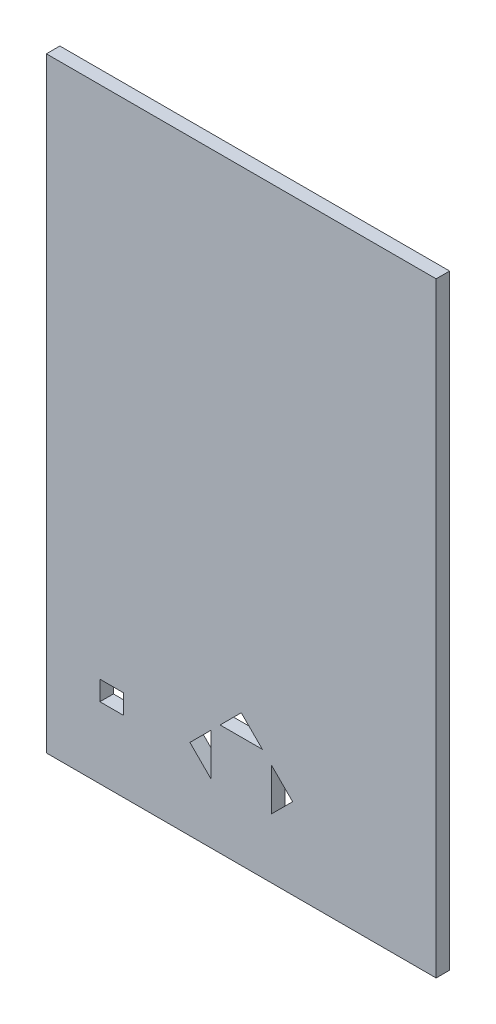
ISO-10303-21;
HEADER;
FILE_DESCRIPTION(('STEP AP214'),'2;1');
FILE_NAME('part.step','',(''),(''),'','','');
FILE_SCHEMA(('AUTOMOTIVE_DESIGN { 1 0 10303 214 1 1 1 1 }'));
ENDSEC;
DATA;
#1=APPLICATION_CONTEXT('core data for automotive mechanical design processes');
#2=APPLICATION_PROTOCOL_DEFINITION('international standard','automotive_design',2000,#1);
#3=PRODUCT_CONTEXT('',#1,'mechanical');
#4=PRODUCT('Part','Part','',(#3));
#5=PRODUCT_RELATED_PRODUCT_CATEGORY('part','',(#4));
#6=PRODUCT_DEFINITION_FORMATION('','',#4);
#7=PRODUCT_DEFINITION_CONTEXT('part definition',#1,'design');
#8=PRODUCT_DEFINITION('design','',#6,#7);
#9=PRODUCT_DEFINITION_SHAPE('','',#8);
#10=(LENGTH_UNIT() NAMED_UNIT(*) SI_UNIT(.MILLI.,.METRE.));
#11=(NAMED_UNIT(*) PLANE_ANGLE_UNIT() SI_UNIT($,.RADIAN.));
#12=(NAMED_UNIT(*) SI_UNIT($,.STERADIAN.) SOLID_ANGLE_UNIT());
#13=UNCERTAINTY_MEASURE_WITH_UNIT(LENGTH_MEASURE(1.E-05),#10,'distance_accuracy_value','');
#14=(GEOMETRIC_REPRESENTATION_CONTEXT(3) GLOBAL_UNCERTAINTY_ASSIGNED_CONTEXT((#13)) GLOBAL_UNIT_ASSIGNED_CONTEXT((#10,
#11,#12)) REPRESENTATION_CONTEXT('',''));
#15=CARTESIAN_POINT('',(0.,0.,0.));
#16=DIRECTION('',(0.,0.,1.));
#17=DIRECTION('',(1.,0.,0.));
#18=AXIS2_PLACEMENT_3D('',#15,#16,#17);
#19=CARTESIAN_POINT('',(-91.7625,142.5625,-6.35));
#20=DIRECTION('',(-1.,0.,0.));
#21=DIRECTION('',(0.,0.,1.));
#22=AXIS2_PLACEMENT_3D('',#19,#20,#21);
#23=PLANE('',#22);
#24=DIRECTION('',(0.,-1.,0.));
#25=VECTOR('',#24,1.);
#26=CARTESIAN_POINT('',(-91.7625,142.5625,0.));
#27=LINE('',#26,#25);
#28=CARTESIAN_POINT('',(-91.7625,142.5625,0.));
#29=VERTEX_POINT('',#28);
#30=CARTESIAN_POINT('',(-91.7625,-142.5625,0.));
#31=VERTEX_POINT('',#30);
#32=EDGE_CURVE('E182',#29,#31,#27,.T.);
#33=ORIENTED_EDGE('',*,*,#32,.F.);
#34=DIRECTION('',(0.,0.,1.));
#35=VECTOR('',#34,1.);
#36=CARTESIAN_POINT('',(-91.7625,142.5625,-6.35));
#37=LINE('',#36,#35);
#38=CARTESIAN_POINT('',(-91.7625,142.5625,-6.35));
#39=VERTEX_POINT('',#38);
#40=EDGE_CURVE('E11',#39,#29,#37,.T.);
#41=ORIENTED_EDGE('',*,*,#40,.F.);
#42=DIRECTION('',(0.,-1.,0.));
#43=VECTOR('',#42,1.);
#44=CARTESIAN_POINT('',(-91.7625,142.5625,-6.35));
#45=LINE('',#44,#43);
#46=CARTESIAN_POINT('',(-91.7625,-142.5625,-6.35));
#47=VERTEX_POINT('',#46);
#48=EDGE_CURVE('E261',#39,#47,#45,.T.);
#49=ORIENTED_EDGE('',*,*,#48,.T.);
#50=DIRECTION('',(0.,0.,1.));
#51=VECTOR('',#50,1.);
#52=CARTESIAN_POINT('',(-91.7625,-142.5625,-6.35));
#53=LINE('',#52,#51);
#54=EDGE_CURVE('E35',#47,#31,#53,.T.);
#55=ORIENTED_EDGE('',*,*,#54,.T.);
#56=EDGE_LOOP('',(#33,#41,#49,#55));
#57=FACE_BOUND('',#56,.T.);
#58=ADVANCED_FACE('F32',(#57),#23,.T.);
#59=CARTESIAN_POINT('',(91.7625,142.5625,-6.35));
#60=DIRECTION('',(0.,1.,0.));
#61=DIRECTION('',(0.,0.,1.));
#62=AXIS2_PLACEMENT_3D('',#59,#60,#61);
#63=PLANE('',#62);
#64=DIRECTION('',(-1.,0.,0.));
#65=VECTOR('',#64,1.);
#66=CARTESIAN_POINT('',(91.7625,142.5625,0.));
#67=LINE('',#66,#65);
#68=CARTESIAN_POINT('',(91.7625,142.5625,0.));
#69=VERTEX_POINT('',#68);
#70=EDGE_CURVE('E265',#69,#29,#67,.T.);
#71=ORIENTED_EDGE('',*,*,#70,.F.);
#72=DIRECTION('',(0.,0.,1.));
#73=VECTOR('',#72,1.);
#74=CARTESIAN_POINT('',(91.7625,142.5625,-6.35));
#75=LINE('',#74,#73);
#76=CARTESIAN_POINT('',(91.7625,142.5625,-6.35));
#77=VERTEX_POINT('',#76);
#78=EDGE_CURVE('E40',#77,#69,#75,.T.);
#79=ORIENTED_EDGE('',*,*,#78,.F.);
#80=DIRECTION('',(-1.,0.,0.));
#81=VECTOR('',#80,1.);
#82=CARTESIAN_POINT('',(91.7625,142.5625,-6.35));
#83=LINE('',#82,#81);
#84=EDGE_CURVE('E271',#77,#39,#83,.T.);
#85=ORIENTED_EDGE('',*,*,#84,.T.);
#86=ORIENTED_EDGE('',*,*,#40,.T.);
#87=EDGE_LOOP('',(#71,#79,#85,#86));
#88=FACE_BOUND('',#87,.T.);
#89=ADVANCED_FACE('F297',(#88),#63,.T.);
#90=CARTESIAN_POINT('',(91.7625,-142.5625,-6.35));
#91=DIRECTION('',(1.,0.,0.));
#92=DIRECTION('',(0.,0.,-1.));
#93=AXIS2_PLACEMENT_3D('',#90,#91,#92);
#94=PLANE('',#93);
#95=DIRECTION('',(0.,1.,0.));
#96=VECTOR('',#95,1.);
#97=CARTESIAN_POINT('',(91.7625,-142.5625,0.));
#98=LINE('',#97,#96);
#99=CARTESIAN_POINT('',(91.7625,-142.5625,0.));
#100=VERTEX_POINT('',#99);
#101=EDGE_CURVE('E279',#100,#69,#98,.T.);
#102=ORIENTED_EDGE('',*,*,#101,.F.);
#103=DIRECTION('',(0.,0.,1.));
#104=VECTOR('',#103,1.);
#105=CARTESIAN_POINT('',(91.7625,-142.5625,-6.35));
#106=LINE('',#105,#104);
#107=CARTESIAN_POINT('',(91.7625,-142.5625,-6.35));
#108=VERTEX_POINT('',#107);
#109=EDGE_CURVE('E284',#108,#100,#106,.T.);
#110=ORIENTED_EDGE('',*,*,#109,.F.);
#111=DIRECTION('',(0.,1.,0.));
#112=VECTOR('',#111,1.);
#113=CARTESIAN_POINT('',(91.7625,-142.5625,-6.35));
#114=LINE('',#113,#112);
#115=EDGE_CURVE('E268',#108,#77,#114,.T.);
#116=ORIENTED_EDGE('',*,*,#115,.T.);
#117=ORIENTED_EDGE('',*,*,#78,.T.);
#118=EDGE_LOOP('',(#102,#110,#116,#117));
#119=FACE_BOUND('',#118,.T.);
#120=ADVANCED_FACE('F302',(#119),#94,.T.);
#121=CARTESIAN_POINT('',(-91.7625,-142.5625,-6.35));
#122=DIRECTION('',(0.,-1.,0.));
#123=DIRECTION('',(0.,0.,-1.));
#124=AXIS2_PLACEMENT_3D('',#121,#122,#123);
#125=PLANE('',#124);
#126=DIRECTION('',(1.,0.,0.));
#127=VECTOR('',#126,1.);
#128=CARTESIAN_POINT('',(-91.7625,-142.5625,0.));
#129=LINE('',#128,#127);
#130=EDGE_CURVE('E276',#31,#100,#129,.T.);
#131=ORIENTED_EDGE('',*,*,#130,.F.);
#132=ORIENTED_EDGE('',*,*,#54,.F.);
#133=DIRECTION('',(1.,0.,0.));
#134=VECTOR('',#133,1.);
#135=CARTESIAN_POINT('',(-91.7625,-142.5625,-6.35));
#136=LINE('',#135,#134);
#137=EDGE_CURVE('E264',#47,#108,#136,.T.);
#138=ORIENTED_EDGE('',*,*,#137,.T.);
#139=ORIENTED_EDGE('',*,*,#109,.T.);
#140=EDGE_LOOP('',(#131,#132,#138,#139));
#141=FACE_BOUND('',#140,.T.);
#142=ADVANCED_FACE('F292',(#141),#125,.T.);
#143=CARTESIAN_POINT('',(0.,0.,-6.35));
#144=DIRECTION('',(0.,0.,1.));
#145=DIRECTION('',(1.,0.,0.));
#146=AXIS2_PLACEMENT_3D('',#143,#144,#145);
#147=PLANE('',#146);
#148=DIRECTION('',(0.,-1.,0.));
#149=VECTOR('',#148,1.);
#150=CARTESIAN_POINT('',(14.2369103576258,-94.5165584539816,-6.35));
#151=LINE('',#150,#149);
#152=CARTESIAN_POINT('',(14.2369103576258,-94.5165584539816,-6.35));
#153=VERTEX_POINT('',#152);
#154=CARTESIAN_POINT('',(14.2369103576258,-114.408441546018,-6.35));
#155=VERTEX_POINT('',#154);
#156=EDGE_CURVE('E48',#153,#155,#151,.T.);
#157=ORIENTED_EDGE('',*,*,#156,.T.);
#158=DIRECTION('',(0.707106781186548,0.707106781186547,0.));
#159=VECTOR('',#158,1.);
#160=CARTESIAN_POINT('',(14.2369103576258,-114.408441546018,-6.35));
#161=LINE('',#160,#159);
#162=CARTESIAN_POINT('',(24.1828519036442,-104.4625,-6.35));
#163=VERTEX_POINT('',#162);
#164=EDGE_CURVE('E155',#155,#163,#161,.T.);
#165=ORIENTED_EDGE('',*,*,#164,.T.);
#166=DIRECTION('',(-0.707106781186548,0.707106781186547,0.));
#167=VECTOR('',#166,1.);
#168=CARTESIAN_POINT('',(24.1828519036442,-104.4625,-6.35));
#169=LINE('',#168,#167);
#170=EDGE_CURVE('E164',#163,#153,#169,.T.);
#171=ORIENTED_EDGE('',*,*,#170,.T.);
#172=EDGE_LOOP('',(#157,#165,#171));
#173=FACE_BOUND('',#172,.T.);
#174=DIRECTION('',(1.,0.,0.));
#175=VECTOR('',#174,1.);
#176=CARTESIAN_POINT('',(-9.94594154601845,-90.2255896423743,-6.35));
#177=LINE('',#176,#175);
#178=CARTESIAN_POINT('',(-9.94594154601845,-90.2255896423743,-6.35));
#179=VERTEX_POINT('',#178);
#180=CARTESIAN_POINT('',(9.94594154601831,-90.2255896423742,-6.35));
#181=VERTEX_POINT('',#180);
#182=EDGE_CURVE('E56',#179,#181,#177,.T.);
#183=ORIENTED_EDGE('',*,*,#182,.T.);
#184=DIRECTION('',(-0.707106781186549,0.707106781186545,0.));
#185=VECTOR('',#184,1.);
#186=CARTESIAN_POINT('',(9.94594154601831,-90.2255896423742,-6.35));
#187=LINE('',#186,#185);
#188=CARTESIAN_POINT('',(0.,-80.2796480963558,-6.35));
#189=VERTEX_POINT('',#188);
#190=EDGE_CURVE('E184',#181,#189,#187,.T.);
#191=ORIENTED_EDGE('',*,*,#190,.T.);
#192=DIRECTION('',(-0.707106781186545,-0.70710678118655,0.));
#193=VECTOR('',#192,1.);
#194=CARTESIAN_POINT('',(0.,-80.2796480963558,-6.35));
#195=LINE('',#194,#193);
#196=EDGE_CURVE('E187',#189,#179,#195,.T.);
#197=ORIENTED_EDGE('',*,*,#196,.T.);
#198=EDGE_LOOP('',(#183,#191,#197));
#199=FACE_BOUND('',#198,.T.);
#200=DIRECTION('',(0.,1.,0.));
#201=VECTOR('',#200,1.);
#202=CARTESIAN_POINT('',(-14.2369103576257,-114.408441546018,-6.35));
#203=LINE('',#202,#201);
#204=CARTESIAN_POINT('',(-14.2369103576257,-114.408441546018,-6.35));
#205=VERTEX_POINT('',#204);
#206=CARTESIAN_POINT('',(-14.2369103576259,-94.5165584539817,-6.35));
#207=VERTEX_POINT('',#206);
#208=EDGE_CURVE('E213',#205,#207,#203,.T.);
#209=ORIENTED_EDGE('',*,*,#208,.T.);
#210=DIRECTION('',(-0.707106781186542,-0.707106781186553,0.));
#211=VECTOR('',#210,1.);
#212=CARTESIAN_POINT('',(-14.2369103576259,-94.5165584539817,-6.35));
#213=LINE('',#212,#211);
#214=CARTESIAN_POINT('',(-24.1828519036442,-104.4625,-6.35));
#215=VERTEX_POINT('',#214);
#216=EDGE_CURVE('E206',#207,#215,#213,.T.);
#217=ORIENTED_EDGE('',*,*,#216,.T.);
#218=DIRECTION('',(0.707106781186553,-0.707106781186542,0.));
#219=VECTOR('',#218,1.);
#220=CARTESIAN_POINT('',(-24.1828519036442,-104.4625,-6.35));
#221=LINE('',#220,#219);
#222=EDGE_CURVE('E209',#215,#205,#221,.T.);
#223=ORIENTED_EDGE('',*,*,#222,.T.);
#224=EDGE_LOOP('',(#209,#217,#223));
#225=FACE_BOUND('',#224,.T.);
#226=DIRECTION('',(-1.,0.,0.));
#227=VECTOR('',#226,1.);
#228=CARTESIAN_POINT('',(-55.359999897,-99.862499929,-6.35));
#229=LINE('',#228,#227);
#230=CARTESIAN_POINT('',(-55.359999897,-99.862499929,-6.35));
#231=VERTEX_POINT('',#230);
#232=CARTESIAN_POINT('',(-66.560000103,-99.862499929,-6.35));
#233=VERTEX_POINT('',#232);
#234=EDGE_CURVE('E240',#231,#233,#229,.T.);
#235=ORIENTED_EDGE('',*,*,#234,.T.);
#236=DIRECTION('',(0.,-1.,0.));
#237=VECTOR('',#236,1.);
#238=CARTESIAN_POINT('',(-66.560000103,-99.862499929,-6.35));
#239=LINE('',#238,#237);
#240=CARTESIAN_POINT('',(-66.560000103,-109.062500071,-6.35));
#241=VERTEX_POINT('',#240);
#242=EDGE_CURVE('E230',#233,#241,#239,.T.);
#243=ORIENTED_EDGE('',*,*,#242,.T.);
#244=DIRECTION('',(1.,0.,0.));
#245=VECTOR('',#244,1.);
#246=CARTESIAN_POINT('',(-55.359999897,-109.062500071,-6.35));
#247=LINE('',#246,#245);
#248=CARTESIAN_POINT('',(-55.359999897,-109.062500071,-6.35));
#249=VERTEX_POINT('',#248);
#250=EDGE_CURVE('E233',#241,#249,#247,.T.);
#251=ORIENTED_EDGE('',*,*,#250,.T.);
#252=DIRECTION('',(0.,1.,0.));
#253=VECTOR('',#252,1.);
#254=CARTESIAN_POINT('',(-55.359999897,-99.862499929,-6.35));
#255=LINE('',#254,#253);
#256=EDGE_CURVE('E237',#249,#231,#255,.T.);
#257=ORIENTED_EDGE('',*,*,#256,.T.);
#258=EDGE_LOOP('',(#235,#243,#251,#257));
#259=FACE_BOUND('',#258,.T.);
#260=ORIENTED_EDGE('',*,*,#48,.F.);
#261=ORIENTED_EDGE('',*,*,#84,.F.);
#262=ORIENTED_EDGE('',*,*,#115,.F.);
#263=ORIENTED_EDGE('',*,*,#137,.F.);
#264=EDGE_LOOP('',(#260,#261,#262,#263));
#265=FACE_BOUND('',#264,.T.);
#266=ADVANCED_FACE('F168',(#173,#199,#225,#259,#265),#147,.F.);
#267=CARTESIAN_POINT('',(0.,0.,0.));
#268=DIRECTION('',(0.,0.,1.));
#269=DIRECTION('',(1.,0.,0.));
#270=AXIS2_PLACEMENT_3D('',#267,#268,#269);
#271=PLANE('',#270);
#272=DIRECTION('',(0.707106781186548,0.707106781186547,0.));
#273=VECTOR('',#272,1.);
#274=CARTESIAN_POINT('',(14.2369103576258,-114.408441546018,0.));
#275=LINE('',#274,#273);
#276=CARTESIAN_POINT('',(14.2369103576258,-114.408441546018,0.));
#277=VERTEX_POINT('',#276);
#278=CARTESIAN_POINT('',(24.1828519036442,-104.4625,0.));
#279=VERTEX_POINT('',#278);
#280=EDGE_CURVE('E157',#277,#279,#275,.T.);
#281=ORIENTED_EDGE('',*,*,#280,.F.);
#282=DIRECTION('',(0.,-1.,0.));
#283=VECTOR('',#282,1.);
#284=CARTESIAN_POINT('',(14.2369103576258,-94.5165584539816,0.));
#285=LINE('',#284,#283);
#286=CARTESIAN_POINT('',(14.2369103576258,-94.5165584539816,0.));
#287=VERTEX_POINT('',#286);
#288=EDGE_CURVE('E170',#287,#277,#285,.T.);
#289=ORIENTED_EDGE('',*,*,#288,.F.);
#290=DIRECTION('',(-0.707106781186548,0.707106781186547,0.));
#291=VECTOR('',#290,1.);
#292=CARTESIAN_POINT('',(24.1828519036442,-104.4625,0.));
#293=LINE('',#292,#291);
#294=EDGE_CURVE('E173',#279,#287,#293,.T.);
#295=ORIENTED_EDGE('',*,*,#294,.F.);
#296=EDGE_LOOP('',(#281,#289,#295));
#297=FACE_BOUND('',#296,.T.);
#298=DIRECTION('',(-0.707106781186549,0.707106781186545,0.));
#299=VECTOR('',#298,1.);
#300=CARTESIAN_POINT('',(9.94594154601831,-90.2255896423742,0.));
#301=LINE('',#300,#299);
#302=CARTESIAN_POINT('',(9.94594154601831,-90.2255896423742,0.));
#303=VERTEX_POINT('',#302);
#304=CARTESIAN_POINT('',(0.,-80.2796480963558,0.));
#305=VERTEX_POINT('',#304);
#306=EDGE_CURVE('E193',#303,#305,#301,.T.);
#307=ORIENTED_EDGE('',*,*,#306,.F.);
#308=DIRECTION('',(1.,0.,0.));
#309=VECTOR('',#308,1.);
#310=CARTESIAN_POINT('',(-9.94594154601845,-90.2255896423743,0.));
#311=LINE('',#310,#309);
#312=CARTESIAN_POINT('',(-9.94594154601845,-90.2255896423743,0.));
#313=VERTEX_POINT('',#312);
#314=EDGE_CURVE('E188',#313,#303,#311,.T.);
#315=ORIENTED_EDGE('',*,*,#314,.F.);
#316=DIRECTION('',(-0.707106781186545,-0.70710678118655,0.));
#317=VECTOR('',#316,1.);
#318=CARTESIAN_POINT('',(0.,-80.2796480963558,0.));
#319=LINE('',#318,#317);
#320=EDGE_CURVE('E195',#305,#313,#319,.T.);
#321=ORIENTED_EDGE('',*,*,#320,.F.);
#322=EDGE_LOOP('',(#307,#315,#321));
#323=FACE_BOUND('',#322,.T.);
#324=DIRECTION('',(-0.707106781186542,-0.707106781186553,0.));
#325=VECTOR('',#324,1.);
#326=CARTESIAN_POINT('',(-14.2369103576259,-94.5165584539817,0.));
#327=LINE('',#326,#325);
#328=CARTESIAN_POINT('',(-14.2369103576259,-94.5165584539817,0.));
#329=VERTEX_POINT('',#328);
#330=CARTESIAN_POINT('',(-24.1828519036442,-104.4625,0.));
#331=VERTEX_POINT('',#330);
#332=EDGE_CURVE('E217',#329,#331,#327,.T.);
#333=ORIENTED_EDGE('',*,*,#332,.F.);
#334=DIRECTION('',(0.,1.,0.));
#335=VECTOR('',#334,1.);
#336=CARTESIAN_POINT('',(-14.2369103576257,-114.408441546018,0.));
#337=LINE('',#336,#335);
#338=CARTESIAN_POINT('',(-14.2369103576257,-114.408441546018,0.));
#339=VERTEX_POINT('',#338);
#340=EDGE_CURVE('E210',#339,#329,#337,.T.);
#341=ORIENTED_EDGE('',*,*,#340,.F.);
#342=DIRECTION('',(0.707106781186553,-0.707106781186542,0.));
#343=VECTOR('',#342,1.);
#344=CARTESIAN_POINT('',(-24.1828519036442,-104.4625,0.));
#345=LINE('',#344,#343);
#346=EDGE_CURVE('E219',#331,#339,#345,.T.);
#347=ORIENTED_EDGE('',*,*,#346,.F.);
#348=EDGE_LOOP('',(#333,#341,#347));
#349=FACE_BOUND('',#348,.T.);
#350=DIRECTION('',(0.,-1.,0.));
#351=VECTOR('',#350,1.);
#352=CARTESIAN_POINT('',(-66.560000103,-99.862499929,0.));
#353=LINE('',#352,#351);
#354=CARTESIAN_POINT('',(-66.560000103,-99.862499929,0.));
#355=VERTEX_POINT('',#354);
#356=CARTESIAN_POINT('',(-66.560000103,-109.062500071,0.));
#357=VERTEX_POINT('',#356);
#358=EDGE_CURVE('E244',#355,#357,#353,.T.);
#359=ORIENTED_EDGE('',*,*,#358,.F.);
#360=DIRECTION('',(-1.,0.,0.));
#361=VECTOR('',#360,1.);
#362=CARTESIAN_POINT('',(-55.359999897,-99.862499929,0.));
#363=LINE('',#362,#361);
#364=CARTESIAN_POINT('',(-55.359999897,-99.862499929,0.));
#365=VERTEX_POINT('',#364);
#366=EDGE_CURVE('E234',#365,#355,#363,.T.);
#367=ORIENTED_EDGE('',*,*,#366,.F.);
#368=DIRECTION('',(0.,1.,0.));
#369=VECTOR('',#368,1.);
#370=CARTESIAN_POINT('',(-55.359999897,-99.862499929,0.));
#371=LINE('',#370,#369);
#372=CARTESIAN_POINT('',(-55.359999897,-109.062500071,0.));
#373=VERTEX_POINT('',#372);
#374=EDGE_CURVE('E249',#373,#365,#371,.T.);
#375=ORIENTED_EDGE('',*,*,#374,.F.);
#376=DIRECTION('',(1.,0.,0.));
#377=VECTOR('',#376,1.);
#378=CARTESIAN_POINT('',(-55.359999897,-109.062500071,0.));
#379=LINE('',#378,#377);
#380=EDGE_CURVE('E246',#357,#373,#379,.T.);
#381=ORIENTED_EDGE('',*,*,#380,.F.);
#382=EDGE_LOOP('',(#359,#367,#375,#381));
#383=FACE_BOUND('',#382,.T.);
#384=ORIENTED_EDGE('',*,*,#32,.T.);
#385=ORIENTED_EDGE('',*,*,#130,.T.);
#386=ORIENTED_EDGE('',*,*,#101,.T.);
#387=ORIENTED_EDGE('',*,*,#70,.T.);
#388=EDGE_LOOP('',(#384,#385,#386,#387));
#389=FACE_BOUND('',#388,.T.);
#390=ADVANCED_FACE('F294',(#297,#323,#349,#383,#389),#271,.T.);
#391=CARTESIAN_POINT('',(-66.560000103,-99.862499929,-6.35));
#392=DIRECTION('',(-1.,0.,0.));
#393=DIRECTION('',(0.,0.,1.));
#394=AXIS2_PLACEMENT_3D('',#391,#392,#393);
#395=PLANE('',#394);
#396=ORIENTED_EDGE('',*,*,#358,.T.);
#397=DIRECTION('',(0.,0.,1.));
#398=VECTOR('',#397,1.);
#399=CARTESIAN_POINT('',(-66.560000103,-109.062500071,-6.35));
#400=LINE('',#399,#398);
#401=EDGE_CURVE('E243',#241,#357,#400,.T.);
#402=ORIENTED_EDGE('',*,*,#401,.F.);
#403=ORIENTED_EDGE('',*,*,#242,.F.);
#404=DIRECTION('',(0.,0.,1.));
#405=VECTOR('',#404,1.);
#406=CARTESIAN_POINT('',(-66.560000103,-99.862499929,-6.35));
#407=LINE('',#406,#405);
#408=EDGE_CURVE('E220',#233,#355,#407,.T.);
#409=ORIENTED_EDGE('',*,*,#408,.T.);
#410=EDGE_LOOP('',(#396,#402,#403,#409));
#411=FACE_BOUND('',#410,.T.);
#412=ADVANCED_FACE('F344',(#411),#395,.F.);
#413=CARTESIAN_POINT('',(-55.359999897,-99.862499929,-6.35));
#414=DIRECTION('',(0.,1.,0.));
#415=DIRECTION('',(0.,0.,1.));
#416=AXIS2_PLACEMENT_3D('',#413,#414,#415);
#417=PLANE('',#416);
#418=ORIENTED_EDGE('',*,*,#366,.T.);
#419=ORIENTED_EDGE('',*,*,#408,.F.);
#420=ORIENTED_EDGE('',*,*,#234,.F.);
#421=DIRECTION('',(0.,0.,1.));
#422=VECTOR('',#421,1.);
#423=CARTESIAN_POINT('',(-55.359999897,-99.862499929,-6.35));
#424=LINE('',#423,#422);
#425=EDGE_CURVE('E255',#231,#365,#424,.T.);
#426=ORIENTED_EDGE('',*,*,#425,.T.);
#427=EDGE_LOOP('',(#418,#419,#420,#426));
#428=FACE_BOUND('',#427,.T.);
#429=ADVANCED_FACE('F354',(#428),#417,.F.);
#430=CARTESIAN_POINT('',(-55.359999897,-99.862499929,-6.35));
#431=DIRECTION('',(1.,0.,0.));
#432=DIRECTION('',(0.,0.,-1.));
#433=AXIS2_PLACEMENT_3D('',#430,#431,#432);
#434=PLANE('',#433);
#435=ORIENTED_EDGE('',*,*,#374,.T.);
#436=ORIENTED_EDGE('',*,*,#425,.F.);
#437=ORIENTED_EDGE('',*,*,#256,.F.);
#438=DIRECTION('',(0.,0.,1.));
#439=VECTOR('',#438,1.);
#440=CARTESIAN_POINT('',(-55.359999897,-109.062500071,-6.35));
#441=LINE('',#440,#439);
#442=EDGE_CURVE('E257',#249,#373,#441,.T.);
#443=ORIENTED_EDGE('',*,*,#442,.T.);
#444=EDGE_LOOP('',(#435,#436,#437,#443));
#445=FACE_BOUND('',#444,.T.);
#446=ADVANCED_FACE('F364',(#445),#434,.F.);
#447=CARTESIAN_POINT('',(-55.359999897,-109.062500071,-6.35));
#448=DIRECTION('',(0.,-1.,0.));
#449=DIRECTION('',(1.,0.,0.));
#450=AXIS2_PLACEMENT_3D('',#447,#448,#449);
#451=PLANE('',#450);
#452=ORIENTED_EDGE('',*,*,#380,.T.);
#453=ORIENTED_EDGE('',*,*,#442,.F.);
#454=ORIENTED_EDGE('',*,*,#250,.F.);
#455=ORIENTED_EDGE('',*,*,#401,.T.);
#456=EDGE_LOOP('',(#452,#453,#454,#455));
#457=FACE_BOUND('',#456,.T.);
#458=ADVANCED_FACE('F374',(#457),#451,.F.);
#459=CARTESIAN_POINT('',(-14.2369103576259,-94.5165584539817,-6.35));
#460=DIRECTION('',(-0.707106781186553,0.707106781186542,0.));
#461=DIRECTION('',(-0.707106781186542,-0.707106781186553,0.));
#462=AXIS2_PLACEMENT_3D('',#459,#460,#461);
#463=PLANE('',#462);
#464=ORIENTED_EDGE('',*,*,#332,.T.);
#465=DIRECTION('',(0.,0.,1.));
#466=VECTOR('',#465,1.);
#467=CARTESIAN_POINT('',(-24.1828519036442,-104.4625,-6.35));
#468=LINE('',#467,#466);
#469=EDGE_CURVE('E216',#215,#331,#468,.T.);
#470=ORIENTED_EDGE('',*,*,#469,.F.);
#471=ORIENTED_EDGE('',*,*,#216,.F.);
#472=DIRECTION('',(0.,0.,1.));
#473=VECTOR('',#472,1.);
#474=CARTESIAN_POINT('',(-14.2369103576259,-94.5165584539817,-6.35));
#475=LINE('',#474,#473);
#476=EDGE_CURVE('E196',#207,#329,#475,.T.);
#477=ORIENTED_EDGE('',*,*,#476,.T.);
#478=EDGE_LOOP('',(#464,#470,#471,#477));
#479=FACE_BOUND('',#478,.T.);
#480=ADVANCED_FACE('F384',(#479),#463,.F.);
#481=CARTESIAN_POINT('',(-14.2369103576257,-114.408441546018,-6.35));
#482=DIRECTION('',(1.,0.,0.));
#483=DIRECTION('',(0.,1.,0.));
#484=AXIS2_PLACEMENT_3D('',#481,#482,#483);
#485=PLANE('',#484);
#486=ORIENTED_EDGE('',*,*,#340,.T.);
#487=ORIENTED_EDGE('',*,*,#476,.F.);
#488=ORIENTED_EDGE('',*,*,#208,.F.);
#489=DIRECTION('',(0.,0.,1.));
#490=VECTOR('',#489,1.);
#491=CARTESIAN_POINT('',(-14.2369103576257,-114.408441546018,-6.35));
#492=LINE('',#491,#490);
#493=EDGE_CURVE('E226',#205,#339,#492,.T.);
#494=ORIENTED_EDGE('',*,*,#493,.T.);
#495=EDGE_LOOP('',(#486,#487,#488,#494));
#496=FACE_BOUND('',#495,.T.);
#497=ADVANCED_FACE('F394',(#496),#485,.F.);
#498=CARTESIAN_POINT('',(-24.1828519036442,-104.4625,-6.35));
#499=DIRECTION('',(-0.707106781186542,-0.707106781186553,0.));
#500=DIRECTION('',(0.707106781186553,-0.707106781186542,0.));
#501=AXIS2_PLACEMENT_3D('',#498,#499,#500);
#502=PLANE('',#501);
#503=ORIENTED_EDGE('',*,*,#346,.T.);
#504=ORIENTED_EDGE('',*,*,#493,.F.);
#505=ORIENTED_EDGE('',*,*,#222,.F.);
#506=ORIENTED_EDGE('',*,*,#469,.T.);
#507=EDGE_LOOP('',(#503,#504,#505,#506));
#508=FACE_BOUND('',#507,.T.);
#509=ADVANCED_FACE('F404',(#508),#502,.F.);
#510=CARTESIAN_POINT('',(9.94594154601831,-90.2255896423742,-6.35));
#511=DIRECTION('',(0.707106781186545,0.707106781186549,0.));
#512=DIRECTION('',(-0.70710678118655,0.707106781186546,0.));
#513=AXIS2_PLACEMENT_3D('',#510,#511,#512);
#514=PLANE('',#513);
#515=ORIENTED_EDGE('',*,*,#306,.T.);
#516=DIRECTION('',(0.,0.,1.));
#517=VECTOR('',#516,1.);
#518=CARTESIAN_POINT('',(0.,-80.2796480963558,-6.35));
#519=LINE('',#518,#517);
#520=EDGE_CURVE('E192',#189,#305,#519,.T.);
#521=ORIENTED_EDGE('',*,*,#520,.F.);
#522=ORIENTED_EDGE('',*,*,#190,.F.);
#523=DIRECTION('',(0.,0.,1.));
#524=VECTOR('',#523,1.);
#525=CARTESIAN_POINT('',(9.94594154601831,-90.2255896423742,-6.35));
#526=LINE('',#525,#524);
#527=EDGE_CURVE('E178',#181,#303,#526,.T.);
#528=ORIENTED_EDGE('',*,*,#527,.T.);
#529=EDGE_LOOP('',(#515,#521,#522,#528));
#530=FACE_BOUND('',#529,.T.);
#531=ADVANCED_FACE('F414',(#530),#514,.F.);
#532=CARTESIAN_POINT('',(-9.94594154601845,-90.2255896423743,-6.35));
#533=DIRECTION('',(0.,-1.,0.));
#534=DIRECTION('',(1.,0.,0.));
#535=AXIS2_PLACEMENT_3D('',#532,#533,#534);
#536=PLANE('',#535);
#537=ORIENTED_EDGE('',*,*,#314,.T.);
#538=ORIENTED_EDGE('',*,*,#527,.F.);
#539=ORIENTED_EDGE('',*,*,#182,.F.);
#540=DIRECTION('',(0.,0.,1.));
#541=VECTOR('',#540,1.);
#542=CARTESIAN_POINT('',(-9.94594154601845,-90.2255896423743,-6.35));
#543=LINE('',#542,#541);
#544=EDGE_CURVE('E202',#179,#313,#543,.T.);
#545=ORIENTED_EDGE('',*,*,#544,.T.);
#546=EDGE_LOOP('',(#537,#538,#539,#545));
#547=FACE_BOUND('',#546,.T.);
#548=ADVANCED_FACE('F424',(#547),#536,.F.);
#549=CARTESIAN_POINT('',(0.,-80.2796480963558,-6.35));
#550=DIRECTION('',(-0.70710678118655,0.707106781186545,0.));
#551=DIRECTION('',(-0.707106781186545,-0.70710678118655,0.));
#552=AXIS2_PLACEMENT_3D('',#549,#550,#551);
#553=PLANE('',#552);
#554=ORIENTED_EDGE('',*,*,#320,.T.);
#555=ORIENTED_EDGE('',*,*,#544,.F.);
#556=ORIENTED_EDGE('',*,*,#196,.F.);
#557=ORIENTED_EDGE('',*,*,#520,.T.);
#558=EDGE_LOOP('',(#554,#555,#556,#557));
#559=FACE_BOUND('',#558,.T.);
#560=ADVANCED_FACE('F434',(#559),#553,.F.);
#561=CARTESIAN_POINT('',(14.2369103576258,-114.408441546018,-6.35));
#562=DIRECTION('',(0.707106781186547,-0.707106781186548,0.));
#563=DIRECTION('',(0.707106781186548,0.707106781186547,0.));
#564=AXIS2_PLACEMENT_3D('',#561,#562,#563);
#565=PLANE('',#564);
#566=ORIENTED_EDGE('',*,*,#280,.T.);
#567=DIRECTION('',(0.,0.,1.));
#568=VECTOR('',#567,1.);
#569=CARTESIAN_POINT('',(24.1828519036442,-104.4625,-6.35));
#570=LINE('',#569,#568);
#571=EDGE_CURVE('E151',#163,#279,#570,.T.);
#572=ORIENTED_EDGE('',*,*,#571,.F.);
#573=ORIENTED_EDGE('',*,*,#164,.F.);
#574=DIRECTION('',(0.,0.,1.));
#575=VECTOR('',#574,1.);
#576=CARTESIAN_POINT('',(14.2369103576258,-114.408441546018,-6.35));
#577=LINE('',#576,#575);
#578=EDGE_CURVE('E180',#155,#277,#577,.T.);
#579=ORIENTED_EDGE('',*,*,#578,.T.);
#580=EDGE_LOOP('',(#566,#572,#573,#579));
#581=FACE_BOUND('',#580,.T.);
#582=ADVANCED_FACE('F153',(#581),#565,.F.);
#583=CARTESIAN_POINT('',(14.2369103576258,-94.5165584539816,-6.35));
#584=DIRECTION('',(-1.,0.,0.));
#585=DIRECTION('',(0.,-1.,0.));
#586=AXIS2_PLACEMENT_3D('',#583,#584,#585);
#587=PLANE('',#586);
#588=ORIENTED_EDGE('',*,*,#288,.T.);
#589=ORIENTED_EDGE('',*,*,#578,.F.);
#590=ORIENTED_EDGE('',*,*,#156,.F.);
#591=DIRECTION('',(0.,0.,1.));
#592=VECTOR('',#591,1.);
#593=CARTESIAN_POINT('',(14.2369103576258,-94.5165584539816,-6.35));
#594=LINE('',#593,#592);
#595=EDGE_CURVE('E161',#153,#287,#594,.T.);
#596=ORIENTED_EDGE('',*,*,#595,.T.);
#597=EDGE_LOOP('',(#588,#589,#590,#596));
#598=FACE_BOUND('',#597,.T.);
#599=ADVANCED_FACE('F452',(#598),#587,.F.);
#600=CARTESIAN_POINT('',(24.1828519036442,-104.4625,-6.35));
#601=DIRECTION('',(0.707106781186547,0.707106781186548,0.));
#602=DIRECTION('',(-0.707106781186548,0.707106781186547,0.));
#603=AXIS2_PLACEMENT_3D('',#600,#601,#602);
#604=PLANE('',#603);
#605=ORIENTED_EDGE('',*,*,#294,.T.);
#606=ORIENTED_EDGE('',*,*,#595,.F.);
#607=ORIENTED_EDGE('',*,*,#170,.F.);
#608=ORIENTED_EDGE('',*,*,#571,.T.);
#609=EDGE_LOOP('',(#605,#606,#607,#608));
#610=FACE_BOUND('',#609,.T.);
#611=ADVANCED_FACE('F165',(#610),#604,.F.);
#612=CLOSED_SHELL('',(#58,#89,#120,#142,#266,#390,#412,#429,#446,#458,#480,#497,#509,#531,#548,
#560,#582,#599,#611));
#613=MANIFOLD_SOLID_BREP('B2',#612);
#614=ADVANCED_BREP_SHAPE_REPRESENTATION('',(#18,#613),#14);
#615=SHAPE_DEFINITION_REPRESENTATION(#9,#614);
ENDSEC;
END-ISO-10303-21;
